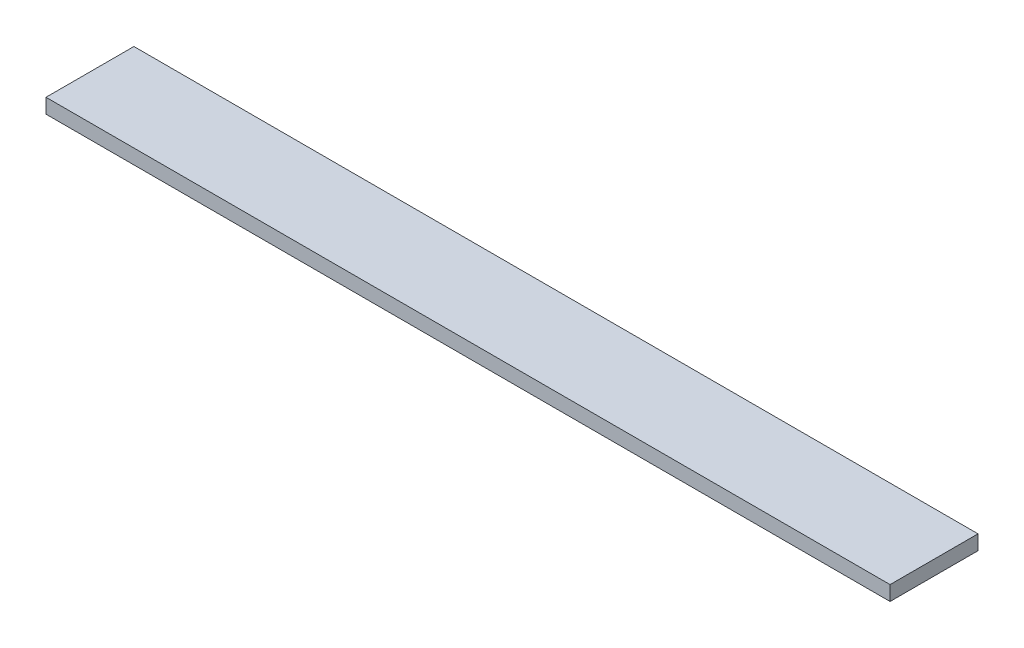
ISO-10303-21;
HEADER;
FILE_DESCRIPTION(('STEP AP214'),'2;1');
FILE_NAME('part.step','',(''),(''),'','','');
FILE_SCHEMA(('AUTOMOTIVE_DESIGN { 1 0 10303 214 1 1 1 1 }'));
ENDSEC;
DATA;
#1=APPLICATION_CONTEXT('core data for automotive mechanical design processes');
#2=APPLICATION_PROTOCOL_DEFINITION('international standard','automotive_design',2000,#1);
#3=PRODUCT_CONTEXT('',#1,'mechanical');
#4=PRODUCT('Part','Part','',(#3));
#5=PRODUCT_RELATED_PRODUCT_CATEGORY('part','',(#4));
#6=PRODUCT_DEFINITION_FORMATION('','',#4);
#7=PRODUCT_DEFINITION_CONTEXT('part definition',#1,'design');
#8=PRODUCT_DEFINITION('design','',#6,#7);
#9=PRODUCT_DEFINITION_SHAPE('','',#8);
#10=(LENGTH_UNIT() NAMED_UNIT(*) SI_UNIT(.MILLI.,.METRE.));
#11=(NAMED_UNIT(*) PLANE_ANGLE_UNIT() SI_UNIT($,.RADIAN.));
#12=(NAMED_UNIT(*) SI_UNIT($,.STERADIAN.) SOLID_ANGLE_UNIT());
#13=UNCERTAINTY_MEASURE_WITH_UNIT(LENGTH_MEASURE(1.E-05),#10,'distance_accuracy_value','');
#14=(GEOMETRIC_REPRESENTATION_CONTEXT(3) GLOBAL_UNCERTAINTY_ASSIGNED_CONTEXT((#13)) GLOBAL_UNIT_ASSIGNED_CONTEXT((#10,
#11,#12)) REPRESENTATION_CONTEXT('',''));
#15=CARTESIAN_POINT('',(0.,0.,0.));
#16=DIRECTION('',(0.,0.,1.));
#17=DIRECTION('',(1.,0.,0.));
#18=AXIS2_PLACEMENT_3D('',#15,#16,#17);
#19=CARTESIAN_POINT('',(0.,15.875,0.));
#20=DIRECTION('',(1.,0.,0.));
#21=DIRECTION('',(0.,0.,-1.));
#22=AXIS2_PLACEMENT_3D('',#19,#20,#21);
#23=PLANE('',#22);
#24=DIRECTION('',(0.,0.,1.));
#25=VECTOR('',#24,1.);
#26=CARTESIAN_POINT('',(0.,0.,0.));
#27=LINE('',#26,#25);
#28=CARTESIAN_POINT('',(0.,0.,-95.25));
#29=VERTEX_POINT('',#28);
#30=CARTESIAN_POINT('',(0.,0.,0.));
#31=VERTEX_POINT('',#30);
#32=EDGE_CURVE('E98',#29,#31,#27,.T.);
#33=ORIENTED_EDGE('',*,*,#32,.T.);
#34=DIRECTION('',(0.,-1.,0.));
#35=VECTOR('',#34,1.);
#36=CARTESIAN_POINT('',(0.,15.875,0.));
#37=LINE('',#36,#35);
#38=CARTESIAN_POINT('',(0.,15.875,0.));
#39=VERTEX_POINT('',#38);
#40=EDGE_CURVE('E11',#39,#31,#37,.T.);
#41=ORIENTED_EDGE('',*,*,#40,.F.);
#42=DIRECTION('',(0.,0.,1.));
#43=VECTOR('',#42,1.);
#44=CARTESIAN_POINT('',(0.,15.875,0.));
#45=LINE('',#44,#43);
#46=CARTESIAN_POINT('',(0.,15.875,-95.25));
#47=VERTEX_POINT('',#46);
#48=EDGE_CURVE('E86',#47,#39,#45,.T.);
#49=ORIENTED_EDGE('',*,*,#48,.F.);
#50=DIRECTION('',(0.,-1.,0.));
#51=VECTOR('',#50,1.);
#52=CARTESIAN_POINT('',(0.,15.875,-95.25));
#53=LINE('',#52,#51);
#54=EDGE_CURVE('E94',#47,#29,#53,.T.);
#55=ORIENTED_EDGE('',*,*,#54,.T.);
#56=EDGE_LOOP('',(#33,#41,#49,#55));
#57=FACE_BOUND('',#56,.T.);
#58=ADVANCED_FACE('F35',(#57),#23,.F.);
#59=CARTESIAN_POINT('',(0.,15.875,0.));
#60=DIRECTION('',(0.,0.,-1.));
#61=DIRECTION('',(-1.,0.,0.));
#62=AXIS2_PLACEMENT_3D('',#59,#60,#61);
#63=PLANE('',#62);
#64=DIRECTION('',(1.,0.,0.));
#65=VECTOR('',#64,1.);
#66=CARTESIAN_POINT('',(0.,0.,0.));
#67=LINE('',#66,#65);
#68=CARTESIAN_POINT('',(914.4,0.,0.));
#69=VERTEX_POINT('',#68);
#70=EDGE_CURVE('E90',#31,#69,#67,.T.);
#71=ORIENTED_EDGE('',*,*,#70,.T.);
#72=DIRECTION('',(0.,-1.,0.));
#73=VECTOR('',#72,1.);
#74=CARTESIAN_POINT('',(914.4,15.875,0.));
#75=LINE('',#74,#73);
#76=CARTESIAN_POINT('',(914.4,15.875,0.));
#77=VERTEX_POINT('',#76);
#78=EDGE_CURVE('E43',#77,#69,#75,.T.);
#79=ORIENTED_EDGE('',*,*,#78,.F.);
#80=DIRECTION('',(1.,0.,0.));
#81=VECTOR('',#80,1.);
#82=CARTESIAN_POINT('',(0.,15.875,0.));
#83=LINE('',#82,#81);
#84=EDGE_CURVE('E81',#39,#77,#83,.T.);
#85=ORIENTED_EDGE('',*,*,#84,.F.);
#86=ORIENTED_EDGE('',*,*,#40,.T.);
#87=EDGE_LOOP('',(#71,#79,#85,#86));
#88=FACE_BOUND('',#87,.T.);
#89=ADVANCED_FACE('F89',(#88),#63,.F.);
#90=CARTESIAN_POINT('',(914.4,15.875,0.));
#91=DIRECTION('',(-1.,0.,0.));
#92=DIRECTION('',(0.,0.,1.));
#93=AXIS2_PLACEMENT_3D('',#90,#91,#92);
#94=PLANE('',#93);
#95=DIRECTION('',(0.,0.,-1.));
#96=VECTOR('',#95,1.);
#97=CARTESIAN_POINT('',(914.4,0.,0.));
#98=LINE('',#97,#96);
#99=CARTESIAN_POINT('',(914.4,0.,-95.25));
#100=VERTEX_POINT('',#99);
#101=EDGE_CURVE('E68',#69,#100,#98,.T.);
#102=ORIENTED_EDGE('',*,*,#101,.T.);
#103=DIRECTION('',(0.,-1.,0.));
#104=VECTOR('',#103,1.);
#105=CARTESIAN_POINT('',(914.4,15.875,-95.25));
#106=LINE('',#105,#104);
#107=CARTESIAN_POINT('',(914.4,15.875,-95.25));
#108=VERTEX_POINT('',#107);
#109=EDGE_CURVE('E91',#108,#100,#106,.T.);
#110=ORIENTED_EDGE('',*,*,#109,.F.);
#111=DIRECTION('',(0.,0.,-1.));
#112=VECTOR('',#111,1.);
#113=CARTESIAN_POINT('',(914.4,15.875,0.));
#114=LINE('',#113,#112);
#115=EDGE_CURVE('E84',#77,#108,#114,.T.);
#116=ORIENTED_EDGE('',*,*,#115,.F.);
#117=ORIENTED_EDGE('',*,*,#78,.T.);
#118=EDGE_LOOP('',(#102,#110,#116,#117));
#119=FACE_BOUND('',#118,.T.);
#120=ADVANCED_FACE('F92',(#119),#94,.F.);
#121=CARTESIAN_POINT('',(0.,15.875,-95.25));
#122=DIRECTION('',(0.,0.,1.));
#123=DIRECTION('',(1.,0.,0.));
#124=AXIS2_PLACEMENT_3D('',#121,#122,#123);
#125=PLANE('',#124);
#126=DIRECTION('',(-1.,0.,0.));
#127=VECTOR('',#126,1.);
#128=CARTESIAN_POINT('',(0.,0.,-95.25));
#129=LINE('',#128,#127);
#130=EDGE_CURVE('E74',#100,#29,#129,.T.);
#131=ORIENTED_EDGE('',*,*,#130,.T.);
#132=ORIENTED_EDGE('',*,*,#54,.F.);
#133=DIRECTION('',(-1.,0.,0.));
#134=VECTOR('',#133,1.);
#135=CARTESIAN_POINT('',(0.,15.875,-95.25));
#136=LINE('',#135,#134);
#137=EDGE_CURVE('E51',#108,#47,#136,.T.);
#138=ORIENTED_EDGE('',*,*,#137,.F.);
#139=ORIENTED_EDGE('',*,*,#109,.T.);
#140=EDGE_LOOP('',(#131,#132,#138,#139));
#141=FACE_BOUND('',#140,.T.);
#142=ADVANCED_FACE('F105',(#141),#125,.F.);
#143=CARTESIAN_POINT('',(0.,15.875,-95.25));
#144=DIRECTION('',(0.,-1.,0.));
#145=DIRECTION('',(0.,0.,-1.));
#146=AXIS2_PLACEMENT_3D('',#143,#144,#145);
#147=PLANE('',#146);
#148=ORIENTED_EDGE('',*,*,#48,.T.);
#149=ORIENTED_EDGE('',*,*,#84,.T.);
#150=ORIENTED_EDGE('',*,*,#115,.T.);
#151=ORIENTED_EDGE('',*,*,#137,.T.);
#152=EDGE_LOOP('',(#148,#149,#150,#151));
#153=FACE_BOUND('',#152,.T.);
#154=ADVANCED_FACE('F82',(#153),#147,.F.);
#155=CARTESIAN_POINT('',(0.,0.,-95.25));
#156=DIRECTION('',(0.,-1.,0.));
#157=DIRECTION('',(0.,0.,-1.));
#158=AXIS2_PLACEMENT_3D('',#155,#156,#157);
#159=PLANE('',#158);
#160=ORIENTED_EDGE('',*,*,#32,.F.);
#161=ORIENTED_EDGE('',*,*,#130,.F.);
#162=ORIENTED_EDGE('',*,*,#101,.F.);
#163=ORIENTED_EDGE('',*,*,#70,.F.);
#164=EDGE_LOOP('',(#160,#161,#162,#163));
#165=FACE_BOUND('',#164,.T.);
#166=ADVANCED_FACE('F108',(#165),#159,.T.);
#167=CLOSED_SHELL('',(#58,#89,#120,#142,#154,#166));
#168=MANIFOLD_SOLID_BREP('B2',#167);
#169=ADVANCED_BREP_SHAPE_REPRESENTATION('',(#18,#168),#14);
#170=SHAPE_DEFINITION_REPRESENTATION(#9,#169);
ENDSEC;
END-ISO-10303-21;
